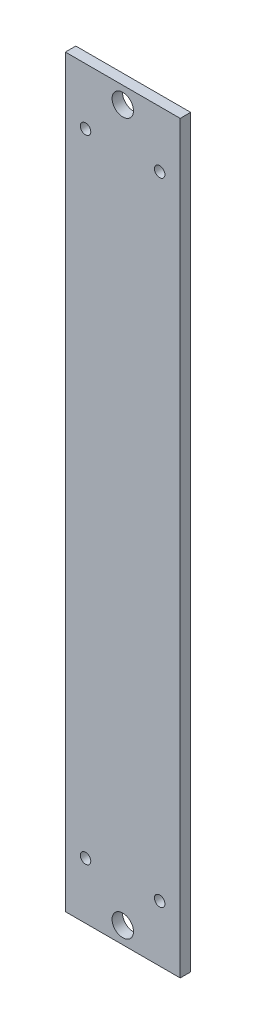
ISO-10303-21;
HEADER;
FILE_DESCRIPTION(('STEP AP214'),'2;1');
FILE_NAME('part.step','',(''),(''),'','','');
FILE_SCHEMA(('AUTOMOTIVE_DESIGN { 1 0 10303 214 1 1 1 1 }'));
ENDSEC;
DATA;
#1=APPLICATION_CONTEXT('core data for automotive mechanical design processes');
#2=APPLICATION_PROTOCOL_DEFINITION('international standard','automotive_design',2000,#1);
#3=PRODUCT_CONTEXT('',#1,'mechanical');
#4=PRODUCT('Part','Part','',(#3));
#5=PRODUCT_RELATED_PRODUCT_CATEGORY('part','',(#4));
#6=PRODUCT_DEFINITION_FORMATION('','',#4);
#7=PRODUCT_DEFINITION_CONTEXT('part definition',#1,'design');
#8=PRODUCT_DEFINITION('design','',#6,#7);
#9=PRODUCT_DEFINITION_SHAPE('','',#8);
#10=(LENGTH_UNIT() NAMED_UNIT(*) SI_UNIT(.MILLI.,.METRE.));
#11=(NAMED_UNIT(*) PLANE_ANGLE_UNIT() SI_UNIT($,.RADIAN.));
#12=(NAMED_UNIT(*) SI_UNIT($,.STERADIAN.) SOLID_ANGLE_UNIT());
#13=UNCERTAINTY_MEASURE_WITH_UNIT(LENGTH_MEASURE(1.E-05),#10,'distance_accuracy_value','');
#14=(GEOMETRIC_REPRESENTATION_CONTEXT(3) GLOBAL_UNCERTAINTY_ASSIGNED_CONTEXT((#13)) GLOBAL_UNIT_ASSIGNED_CONTEXT((#10,
#11,#12)) REPRESENTATION_CONTEXT('',''));
#15=CARTESIAN_POINT('',(0.,0.,0.));
#16=DIRECTION('',(0.,0.,1.));
#17=DIRECTION('',(1.,0.,0.));
#18=AXIS2_PLACEMENT_3D('',#15,#16,#17);
#19=CARTESIAN_POINT('',(0.,0.,3.1));
#20=DIRECTION('',(0.,0.,-1.));
#21=DIRECTION('',(-1.,0.,0.));
#22=AXIS2_PLACEMENT_3D('',#19,#20,#21);
#23=PLANE('',#22);
#24=CARTESIAN_POINT('',(28.,16.75,3.1));
#25=DIRECTION('',(0.,0.,1.));
#26=DIRECTION('',(1.,0.,0.));
#27=AXIS2_PLACEMENT_3D('',#24,#25,#26);
#28=CIRCLE('',#27,1.55);
#29=CARTESIAN_POINT('',(29.55,16.75,3.1));
#30=VERTEX_POINT('',#29);
#31=EDGE_CURVE('E133',#30,#30,#28,.T.);
#32=ORIENTED_EDGE('',*,*,#31,.F.);
#33=EDGE_LOOP('',(#32));
#34=FACE_BOUND('',#33,.T.);
#35=CARTESIAN_POINT('',(5.99999999999998,204.25,3.1));
#36=DIRECTION('',(0.,0.,1.));
#37=DIRECTION('',(1.,0.,0.));
#38=AXIS2_PLACEMENT_3D('',#35,#36,#37);
#39=CIRCLE('',#38,1.55);
#40=CARTESIAN_POINT('',(7.54999999999998,204.25,3.1));
#41=VERTEX_POINT('',#40);
#42=EDGE_CURVE('E121',#41,#41,#39,.T.);
#43=ORIENTED_EDGE('',*,*,#42,.F.);
#44=EDGE_LOOP('',(#43));
#45=FACE_BOUND('',#44,.T.);
#46=CARTESIAN_POINT('',(17.05,216.,3.1));
#47=DIRECTION('',(0.,0.,1.));
#48=DIRECTION('',(1.,0.,0.));
#49=AXIS2_PLACEMENT_3D('',#46,#47,#48);
#50=CIRCLE('',#49,3.175);
#51=CARTESIAN_POINT('',(20.225,216.,3.1));
#52=VERTEX_POINT('',#51);
#53=EDGE_CURVE('E100',#52,#52,#50,.T.);
#54=ORIENTED_EDGE('',*,*,#53,.F.);
#55=EDGE_LOOP('',(#54));
#56=FACE_BOUND('',#55,.T.);
#57=DIRECTION('',(0.,-1.,0.));
#58=VECTOR('',#57,1.);
#59=CARTESIAN_POINT('',(0.,0.,3.1));
#60=LINE('',#59,#58);
#61=CARTESIAN_POINT('',(0.,221.,3.1));
#62=VERTEX_POINT('',#61);
#63=CARTESIAN_POINT('',(0.,0.,3.1));
#64=VERTEX_POINT('',#63);
#65=EDGE_CURVE('E85',#62,#64,#60,.T.);
#66=ORIENTED_EDGE('',*,*,#65,.T.);
#67=DIRECTION('',(1.,0.,0.));
#68=VECTOR('',#67,1.);
#69=CARTESIAN_POINT('',(0.,0.,3.1));
#70=LINE('',#69,#68);
#71=CARTESIAN_POINT('',(34.1,0.,3.1));
#72=VERTEX_POINT('',#71);
#73=EDGE_CURVE('E80',#64,#72,#70,.T.);
#74=ORIENTED_EDGE('',*,*,#73,.T.);
#75=DIRECTION('',(0.,1.,0.));
#76=VECTOR('',#75,1.);
#77=CARTESIAN_POINT('',(34.1,0.,3.1));
#78=LINE('',#77,#76);
#79=CARTESIAN_POINT('',(34.1,221.,3.1));
#80=VERTEX_POINT('',#79);
#81=EDGE_CURVE('E83',#72,#80,#78,.T.);
#82=ORIENTED_EDGE('',*,*,#81,.T.);
#83=DIRECTION('',(-1.,0.,0.));
#84=VECTOR('',#83,1.);
#85=CARTESIAN_POINT('',(0.,221.,3.1));
#86=LINE('',#85,#84);
#87=EDGE_CURVE('E50',#80,#62,#86,.T.);
#88=ORIENTED_EDGE('',*,*,#87,.T.);
#89=EDGE_LOOP('',(#66,#74,#82,#88));
#90=FACE_BOUND('',#89,.T.);
#91=CARTESIAN_POINT('',(17.05,5.,3.1));
#92=DIRECTION('',(0.,0.,1.));
#93=DIRECTION('',(1.,0.,0.));
#94=AXIS2_PLACEMENT_3D('',#91,#92,#93);
#95=CIRCLE('',#94,3.175);
#96=CARTESIAN_POINT('',(20.225,5.,3.1));
#97=VERTEX_POINT('',#96);
#98=EDGE_CURVE('E115',#97,#97,#95,.T.);
#99=ORIENTED_EDGE('',*,*,#98,.F.);
#100=EDGE_LOOP('',(#99));
#101=FACE_BOUND('',#100,.T.);
#102=CARTESIAN_POINT('',(28.,204.25,3.1));
#103=DIRECTION('',(0.,0.,1.));
#104=DIRECTION('',(1.,0.,0.));
#105=AXIS2_PLACEMENT_3D('',#102,#103,#104);
#106=CIRCLE('',#105,1.55);
#107=CARTESIAN_POINT('',(29.55,204.25,3.1));
#108=VERTEX_POINT('',#107);
#109=EDGE_CURVE('E127',#108,#108,#106,.T.);
#110=ORIENTED_EDGE('',*,*,#109,.F.);
#111=EDGE_LOOP('',(#110));
#112=FACE_BOUND('',#111,.T.);
#113=CARTESIAN_POINT('',(6.,16.75,3.1));
#114=DIRECTION('',(0.,0.,1.));
#115=DIRECTION('',(1.,0.,0.));
#116=AXIS2_PLACEMENT_3D('',#113,#114,#115);
#117=CIRCLE('',#116,1.55);
#118=CARTESIAN_POINT('',(7.55,16.75,3.1));
#119=VERTEX_POINT('',#118);
#120=EDGE_CURVE('E139',#119,#119,#117,.T.);
#121=ORIENTED_EDGE('',*,*,#120,.F.);
#122=EDGE_LOOP('',(#121));
#123=FACE_BOUND('',#122,.T.);
#124=ADVANCED_FACE('F33',(#34,#45,#56,#90,#101,#112,#123),#23,.F.);
#125=CARTESIAN_POINT('',(0.,0.,0.));
#126=DIRECTION('',(0.,0.,-1.));
#127=DIRECTION('',(-1.,0.,0.));
#128=AXIS2_PLACEMENT_3D('',#125,#126,#127);
#129=PLANE('',#128);
#130=CARTESIAN_POINT('',(28.,16.75,0.));
#131=DIRECTION('',(0.,0.,1.));
#132=DIRECTION('',(1.,0.,0.));
#133=AXIS2_PLACEMENT_3D('',#130,#131,#132);
#134=CIRCLE('',#133,1.55);
#135=CARTESIAN_POINT('',(29.55,16.75,0.));
#136=VERTEX_POINT('',#135);
#137=EDGE_CURVE('E136',#136,#136,#134,.T.);
#138=ORIENTED_EDGE('',*,*,#137,.T.);
#139=EDGE_LOOP('',(#138));
#140=FACE_BOUND('',#139,.T.);
#141=CARTESIAN_POINT('',(5.99999999999998,204.25,0.));
#142=DIRECTION('',(0.,0.,1.));
#143=DIRECTION('',(1.,0.,0.));
#144=AXIS2_PLACEMENT_3D('',#141,#142,#143);
#145=CIRCLE('',#144,1.55);
#146=CARTESIAN_POINT('',(7.54999999999998,204.25,0.));
#147=VERTEX_POINT('',#146);
#148=EDGE_CURVE('E124',#147,#147,#145,.T.);
#149=ORIENTED_EDGE('',*,*,#148,.T.);
#150=EDGE_LOOP('',(#149));
#151=FACE_BOUND('',#150,.T.);
#152=CARTESIAN_POINT('',(17.05,216.,0.));
#153=DIRECTION('',(0.,0.,1.));
#154=DIRECTION('',(1.,0.,0.));
#155=AXIS2_PLACEMENT_3D('',#152,#153,#154);
#156=CIRCLE('',#155,3.175);
#157=CARTESIAN_POINT('',(20.225,216.,0.));
#158=VERTEX_POINT('',#157);
#159=EDGE_CURVE('E112',#158,#158,#156,.T.);
#160=ORIENTED_EDGE('',*,*,#159,.T.);
#161=EDGE_LOOP('',(#160));
#162=FACE_BOUND('',#161,.T.);
#163=DIRECTION('',(0.,-1.,0.));
#164=VECTOR('',#163,1.);
#165=CARTESIAN_POINT('',(0.,0.,0.));
#166=LINE('',#165,#164);
#167=CARTESIAN_POINT('',(0.,221.,0.));
#168=VERTEX_POINT('',#167);
#169=CARTESIAN_POINT('',(0.,0.,0.));
#170=VERTEX_POINT('',#169);
#171=EDGE_CURVE('E97',#168,#170,#166,.T.);
#172=ORIENTED_EDGE('',*,*,#171,.F.);
#173=DIRECTION('',(-1.,0.,0.));
#174=VECTOR('',#173,1.);
#175=CARTESIAN_POINT('',(0.,221.,0.));
#176=LINE('',#175,#174);
#177=CARTESIAN_POINT('',(34.1,221.,0.));
#178=VERTEX_POINT('',#177);
#179=EDGE_CURVE('E73',#178,#168,#176,.T.);
#180=ORIENTED_EDGE('',*,*,#179,.F.);
#181=DIRECTION('',(0.,1.,0.));
#182=VECTOR('',#181,1.);
#183=CARTESIAN_POINT('',(34.1,0.,0.));
#184=LINE('',#183,#182);
#185=CARTESIAN_POINT('',(34.1,0.,0.));
#186=VERTEX_POINT('',#185);
#187=EDGE_CURVE('E67',#186,#178,#184,.T.);
#188=ORIENTED_EDGE('',*,*,#187,.F.);
#189=DIRECTION('',(1.,0.,0.));
#190=VECTOR('',#189,1.);
#191=CARTESIAN_POINT('',(0.,0.,0.));
#192=LINE('',#191,#190);
#193=EDGE_CURVE('E89',#170,#186,#192,.T.);
#194=ORIENTED_EDGE('',*,*,#193,.F.);
#195=EDGE_LOOP('',(#172,#180,#188,#194));
#196=FACE_BOUND('',#195,.T.);
#197=CARTESIAN_POINT('',(17.05,5.,0.));
#198=DIRECTION('',(0.,0.,1.));
#199=DIRECTION('',(1.,0.,0.));
#200=AXIS2_PLACEMENT_3D('',#197,#198,#199);
#201=CIRCLE('',#200,3.175);
#202=CARTESIAN_POINT('',(20.225,5.,0.));
#203=VERTEX_POINT('',#202);
#204=EDGE_CURVE('E118',#203,#203,#201,.T.);
#205=ORIENTED_EDGE('',*,*,#204,.T.);
#206=EDGE_LOOP('',(#205));
#207=FACE_BOUND('',#206,.T.);
#208=CARTESIAN_POINT('',(28.,204.25,0.));
#209=DIRECTION('',(0.,0.,1.));
#210=DIRECTION('',(1.,0.,0.));
#211=AXIS2_PLACEMENT_3D('',#208,#209,#210);
#212=CIRCLE('',#211,1.55);
#213=CARTESIAN_POINT('',(29.55,204.25,0.));
#214=VERTEX_POINT('',#213);
#215=EDGE_CURVE('E130',#214,#214,#212,.T.);
#216=ORIENTED_EDGE('',*,*,#215,.T.);
#217=EDGE_LOOP('',(#216));
#218=FACE_BOUND('',#217,.T.);
#219=CARTESIAN_POINT('',(6.,16.75,0.));
#220=DIRECTION('',(0.,0.,1.));
#221=DIRECTION('',(1.,0.,0.));
#222=AXIS2_PLACEMENT_3D('',#219,#220,#221);
#223=CIRCLE('',#222,1.55);
#224=CARTESIAN_POINT('',(7.55,16.75,0.));
#225=VERTEX_POINT('',#224);
#226=EDGE_CURVE('E142',#225,#225,#223,.T.);
#227=ORIENTED_EDGE('',*,*,#226,.T.);
#228=EDGE_LOOP('',(#227));
#229=FACE_BOUND('',#228,.T.);
#230=ADVANCED_FACE('F108',(#140,#151,#162,#196,#207,#218,#229),#129,.T.);
#231=CARTESIAN_POINT('',(0.,0.,3.1));
#232=DIRECTION('',(1.,0.,0.));
#233=DIRECTION('',(0.,0.,-1.));
#234=AXIS2_PLACEMENT_3D('',#231,#232,#233);
#235=PLANE('',#234);
#236=ORIENTED_EDGE('',*,*,#171,.T.);
#237=DIRECTION('',(0.,0.,-1.));
#238=VECTOR('',#237,1.);
#239=CARTESIAN_POINT('',(0.,0.,3.1));
#240=LINE('',#239,#238);
#241=EDGE_CURVE('E11',#64,#170,#240,.T.);
#242=ORIENTED_EDGE('',*,*,#241,.F.);
#243=ORIENTED_EDGE('',*,*,#65,.F.);
#244=DIRECTION('',(0.,0.,-1.));
#245=VECTOR('',#244,1.);
#246=CARTESIAN_POINT('',(0.,221.,3.1));
#247=LINE('',#246,#245);
#248=EDGE_CURVE('E93',#62,#168,#247,.T.);
#249=ORIENTED_EDGE('',*,*,#248,.T.);
#250=EDGE_LOOP('',(#236,#242,#243,#249));
#251=FACE_BOUND('',#250,.T.);
#252=ADVANCED_FACE('F35',(#251),#235,.F.);
#253=CARTESIAN_POINT('',(0.,0.,3.1));
#254=DIRECTION('',(0.,1.,0.));
#255=DIRECTION('',(0.,0.,1.));
#256=AXIS2_PLACEMENT_3D('',#253,#254,#255);
#257=PLANE('',#256);
#258=ORIENTED_EDGE('',*,*,#193,.T.);
#259=DIRECTION('',(0.,0.,-1.));
#260=VECTOR('',#259,1.);
#261=CARTESIAN_POINT('',(34.1,0.,3.1));
#262=LINE('',#261,#260);
#263=EDGE_CURVE('E42',#72,#186,#262,.T.);
#264=ORIENTED_EDGE('',*,*,#263,.F.);
#265=ORIENTED_EDGE('',*,*,#73,.F.);
#266=ORIENTED_EDGE('',*,*,#241,.T.);
#267=EDGE_LOOP('',(#258,#264,#265,#266));
#268=FACE_BOUND('',#267,.T.);
#269=ADVANCED_FACE('F88',(#268),#257,.F.);
#270=CARTESIAN_POINT('',(34.1,0.,3.1));
#271=DIRECTION('',(-1.,0.,0.));
#272=DIRECTION('',(0.,0.,1.));
#273=AXIS2_PLACEMENT_3D('',#270,#271,#272);
#274=PLANE('',#273);
#275=ORIENTED_EDGE('',*,*,#187,.T.);
#276=DIRECTION('',(0.,0.,-1.));
#277=VECTOR('',#276,1.);
#278=CARTESIAN_POINT('',(34.1,221.,3.1));
#279=LINE('',#278,#277);
#280=EDGE_CURVE('E90',#80,#178,#279,.T.);
#281=ORIENTED_EDGE('',*,*,#280,.F.);
#282=ORIENTED_EDGE('',*,*,#81,.F.);
#283=ORIENTED_EDGE('',*,*,#263,.T.);
#284=EDGE_LOOP('',(#275,#281,#282,#283));
#285=FACE_BOUND('',#284,.T.);
#286=ADVANCED_FACE('F91',(#285),#274,.F.);
#287=CARTESIAN_POINT('',(0.,221.,3.1));
#288=DIRECTION('',(0.,-1.,0.));
#289=DIRECTION('',(0.,0.,-1.));
#290=AXIS2_PLACEMENT_3D('',#287,#288,#289);
#291=PLANE('',#290);
#292=ORIENTED_EDGE('',*,*,#179,.T.);
#293=ORIENTED_EDGE('',*,*,#248,.F.);
#294=ORIENTED_EDGE('',*,*,#87,.F.);
#295=ORIENTED_EDGE('',*,*,#280,.T.);
#296=EDGE_LOOP('',(#292,#293,#294,#295));
#297=FACE_BOUND('',#296,.T.);
#298=ADVANCED_FACE('F105',(#297),#291,.F.);
#299=CARTESIAN_POINT('',(17.05,216.,3.1));
#300=DIRECTION('',(0.,0.,-1.));
#301=DIRECTION('',(-1.,0.,0.));
#302=AXIS2_PLACEMENT_3D('',#299,#300,#301);
#303=CYLINDRICAL_SURFACE('',#302,3.175);
#304=ORIENTED_EDGE('',*,*,#53,.T.);
#305=EDGE_LOOP('',(#304));
#306=FACE_BOUND('',#305,.T.);
#307=ORIENTED_EDGE('',*,*,#159,.F.);
#308=EDGE_LOOP('',(#307));
#309=FACE_BOUND('',#308,.T.);
#310=ADVANCED_FACE('F162',(#306,#309),#303,.F.);
#311=CARTESIAN_POINT('',(17.05,5.,3.1));
#312=DIRECTION('',(0.,0.,-1.));
#313=DIRECTION('',(-1.,0.,0.));
#314=AXIS2_PLACEMENT_3D('',#311,#312,#313);
#315=CYLINDRICAL_SURFACE('',#314,3.175);
#316=ORIENTED_EDGE('',*,*,#98,.T.);
#317=EDGE_LOOP('',(#316));
#318=FACE_BOUND('',#317,.T.);
#319=ORIENTED_EDGE('',*,*,#204,.F.);
#320=EDGE_LOOP('',(#319));
#321=FACE_BOUND('',#320,.T.);
#322=ADVANCED_FACE('F208',(#318,#321),#315,.F.);
#323=CARTESIAN_POINT('',(5.99999999999998,204.25,3.1));
#324=DIRECTION('',(0.,0.,-1.));
#325=DIRECTION('',(-1.,0.,0.));
#326=AXIS2_PLACEMENT_3D('',#323,#324,#325);
#327=CYLINDRICAL_SURFACE('',#326,1.55);
#328=ORIENTED_EDGE('',*,*,#42,.T.);
#329=EDGE_LOOP('',(#328));
#330=FACE_BOUND('',#329,.T.);
#331=ORIENTED_EDGE('',*,*,#148,.F.);
#332=EDGE_LOOP('',(#331));
#333=FACE_BOUND('',#332,.T.);
#334=ADVANCED_FACE('F216',(#330,#333),#327,.F.);
#335=CARTESIAN_POINT('',(28.,204.25,3.1));
#336=DIRECTION('',(0.,0.,-1.));
#337=DIRECTION('',(-1.,0.,0.));
#338=AXIS2_PLACEMENT_3D('',#335,#336,#337);
#339=CYLINDRICAL_SURFACE('',#338,1.55);
#340=ORIENTED_EDGE('',*,*,#109,.T.);
#341=EDGE_LOOP('',(#340));
#342=FACE_BOUND('',#341,.T.);
#343=ORIENTED_EDGE('',*,*,#215,.F.);
#344=EDGE_LOOP('',(#343));
#345=FACE_BOUND('',#344,.T.);
#346=ADVANCED_FACE('F224',(#342,#345),#339,.F.);
#347=CARTESIAN_POINT('',(28.,16.75,3.1));
#348=DIRECTION('',(0.,0.,-1.));
#349=DIRECTION('',(-1.,0.,0.));
#350=AXIS2_PLACEMENT_3D('',#347,#348,#349);
#351=CYLINDRICAL_SURFACE('',#350,1.55);
#352=ORIENTED_EDGE('',*,*,#31,.T.);
#353=EDGE_LOOP('',(#352));
#354=FACE_BOUND('',#353,.T.);
#355=ORIENTED_EDGE('',*,*,#137,.F.);
#356=EDGE_LOOP('',(#355));
#357=FACE_BOUND('',#356,.T.);
#358=ADVANCED_FACE('F233',(#354,#357),#351,.F.);
#359=CARTESIAN_POINT('',(6.,16.75,3.1));
#360=DIRECTION('',(0.,0.,-1.));
#361=DIRECTION('',(-1.,0.,0.));
#362=AXIS2_PLACEMENT_3D('',#359,#360,#361);
#363=CYLINDRICAL_SURFACE('',#362,1.55);
#364=ORIENTED_EDGE('',*,*,#120,.T.);
#365=EDGE_LOOP('',(#364));
#366=FACE_BOUND('',#365,.T.);
#367=ORIENTED_EDGE('',*,*,#226,.F.);
#368=EDGE_LOOP('',(#367));
#369=FACE_BOUND('',#368,.T.);
#370=ADVANCED_FACE('F148',(#366,#369),#363,.F.);
#371=CLOSED_SHELL('',(#124,#230,#252,#269,#286,#298,#310,#322,#334,#346,#358,#370));
#372=MANIFOLD_SOLID_BREP('B2',#371);
#373=ADVANCED_BREP_SHAPE_REPRESENTATION('',(#18,#372),#14);
#374=SHAPE_DEFINITION_REPRESENTATION(#9,#373);
ENDSEC;
END-ISO-10303-21;
